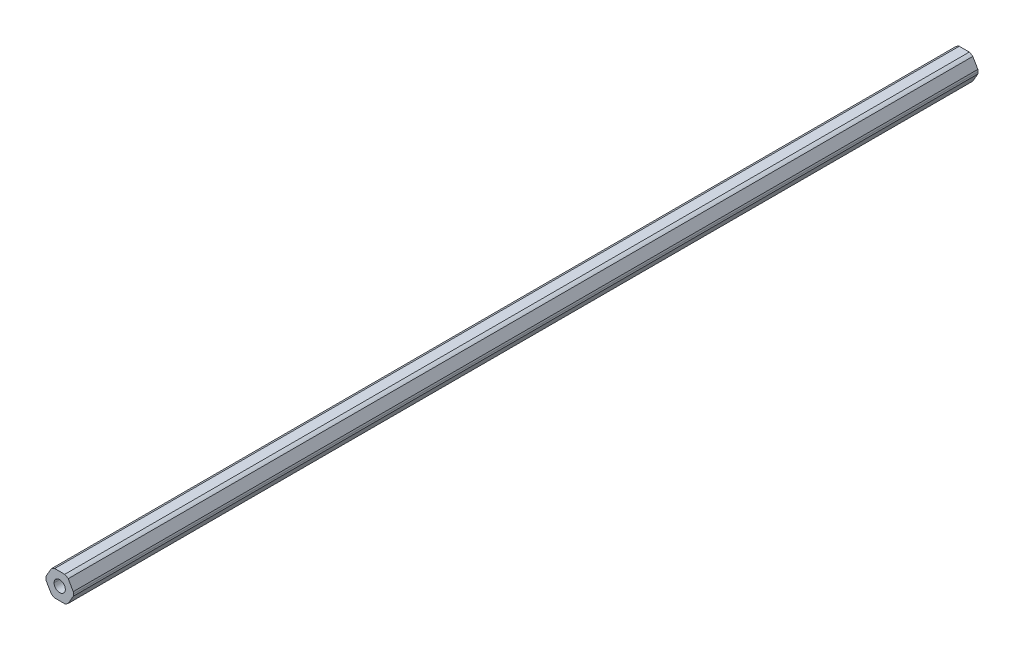
ISO-10303-21;
HEADER;
FILE_DESCRIPTION(('STEP AP214'),'2;1');
FILE_NAME('part.step','',(''),(''),'','','');
FILE_SCHEMA(('AUTOMOTIVE_DESIGN { 1 0 10303 214 1 1 1 1 }'));
ENDSEC;
DATA;
#1=APPLICATION_CONTEXT('core data for automotive mechanical design processes');
#2=APPLICATION_PROTOCOL_DEFINITION('international standard','automotive_design',2000,#1);
#3=PRODUCT_CONTEXT('',#1,'mechanical');
#4=PRODUCT('Part','Part','',(#3));
#5=PRODUCT_RELATED_PRODUCT_CATEGORY('part','',(#4));
#6=PRODUCT_DEFINITION_FORMATION('','',#4);
#7=PRODUCT_DEFINITION_CONTEXT('part definition',#1,'design');
#8=PRODUCT_DEFINITION('design','',#6,#7);
#9=PRODUCT_DEFINITION_SHAPE('','',#8);
#10=(LENGTH_UNIT() NAMED_UNIT(*) SI_UNIT(.MILLI.,.METRE.));
#11=(NAMED_UNIT(*) PLANE_ANGLE_UNIT() SI_UNIT($,.RADIAN.));
#12=(NAMED_UNIT(*) SI_UNIT($,.STERADIAN.) SOLID_ANGLE_UNIT());
#13=UNCERTAINTY_MEASURE_WITH_UNIT(LENGTH_MEASURE(1.E-05),#10,'distance_accuracy_value','');
#14=(GEOMETRIC_REPRESENTATION_CONTEXT(3) GLOBAL_UNCERTAINTY_ASSIGNED_CONTEXT((#13)) GLOBAL_UNIT_ASSIGNED_CONTEXT((#10,
#11,#12)) REPRESENTATION_CONTEXT('',''));
#15=CARTESIAN_POINT('',(0.,0.,0.));
#16=DIRECTION('',(0.,0.,1.));
#17=DIRECTION('',(1.,0.,0.));
#18=AXIS2_PLACEMENT_3D('',#15,#16,#17);
#19=CARTESIAN_POINT('',(0.,0.,-457.2));
#20=DIRECTION('',(0.,0.,1.));
#21=DIRECTION('',(1.,0.,0.));
#22=AXIS2_PLACEMENT_3D('',#19,#20,#21);
#23=CYLINDRICAL_SURFACE('',#22,2.1);
#24=CARTESIAN_POINT('',(0.,0.,-119.38));
#25=DIRECTION('',(0.,0.,1.));
#26=DIRECTION('',(1.,0.,0.));
#27=AXIS2_PLACEMENT_3D('',#24,#25,#26);
#28=CIRCLE('',#27,2.1);
#29=CARTESIAN_POINT('',(2.1,0.,-119.38));
#30=VERTEX_POINT('',#29);
#31=CARTESIAN_POINT('',(-2.1,0.,-119.38));
#32=VERTEX_POINT('',#31);
#33=EDGE_CURVE('E67',#30,#32,#28,.F.);
#34=ORIENTED_EDGE('',*,*,#33,.F.);
#35=DIRECTION('',(0.,0.,1.));
#36=VECTOR('',#35,1.);
#37=CARTESIAN_POINT('',(2.1,0.,-457.2));
#38=LINE('',#37,#36);
#39=CARTESIAN_POINT('',(2.1,0.,-457.2));
#40=VERTEX_POINT('',#39);
#41=EDGE_CURVE('E213',#40,#30,#38,.T.);
#42=ORIENTED_EDGE('',*,*,#41,.F.);
#43=CARTESIAN_POINT('',(0.,0.,-457.2));
#44=DIRECTION('',(0.,0.,1.));
#45=DIRECTION('',(1.,0.,0.));
#46=AXIS2_PLACEMENT_3D('',#43,#44,#45);
#47=CIRCLE('',#46,2.1);
#48=CARTESIAN_POINT('',(-2.1,0.,-457.2));
#49=VERTEX_POINT('',#48);
#50=EDGE_CURVE('E193',#49,#40,#47,.T.);
#51=ORIENTED_EDGE('',*,*,#50,.F.);
#52=DIRECTION('',(0.,0.,1.));
#53=VECTOR('',#52,1.);
#54=CARTESIAN_POINT('',(-2.1,0.,-457.2));
#55=LINE('',#54,#53);
#56=EDGE_CURVE('E54',#49,#32,#55,.T.);
#57=ORIENTED_EDGE('',*,*,#56,.T.);
#58=EDGE_LOOP('',(#34,#42,#51,#57));
#59=FACE_BOUND('',#58,.T.);
#60=ADVANCED_FACE('F46',(#59),#23,.F.);
#61=CARTESIAN_POINT('',(0.,0.,-457.2));
#62=DIRECTION('',(0.,0.,1.));
#63=DIRECTION('',(1.,0.,0.));
#64=AXIS2_PLACEMENT_3D('',#61,#62,#63);
#65=CYLINDRICAL_SURFACE('',#64,5.12);
#66=DIRECTION('',(0.,0.,1.));
#67=VECTOR('',#66,1.);
#68=CARTESIAN_POINT('',(5.12,0.,-457.2));
#69=LINE('',#68,#67);
#70=CARTESIAN_POINT('',(5.12,0.,-457.2));
#71=VERTEX_POINT('',#70);
#72=CARTESIAN_POINT('',(5.12,0.,-119.38));
#73=VERTEX_POINT('',#72);
#74=EDGE_CURVE('E229',#71,#73,#69,.T.);
#75=ORIENTED_EDGE('',*,*,#74,.T.);
#76=CARTESIAN_POINT('',(0.,0.,-119.38));
#77=DIRECTION('',(0.,0.,1.));
#78=DIRECTION('',(1.,0.,0.));
#79=AXIS2_PLACEMENT_3D('',#76,#77,#78);
#80=CIRCLE('',#79,5.12);
#81=CARTESIAN_POINT('',(5.06425896558911,-0.753446168913433,-119.38));
#82=VERTEX_POINT('',#81);
#83=EDGE_CURVE('E168',#82,#73,#80,.T.);
#84=ORIENTED_EDGE('',*,*,#83,.F.);
#85=DIRECTION('',(0.,0.,-1.));
#86=VECTOR('',#85,1.);
#87=CARTESIAN_POINT('',(5.06425896558911,-0.753446168913433,-457.2));
#88=LINE('',#87,#86);
#89=CARTESIAN_POINT('',(5.06425896558911,-0.753446168913433,-457.2));
#90=VERTEX_POINT('',#89);
#91=EDGE_CURVE('E232',#82,#90,#88,.T.);
#92=ORIENTED_EDGE('',*,*,#91,.T.);
#93=CARTESIAN_POINT('',(0.,0.,-457.2));
#94=DIRECTION('',(0.,0.,1.));
#95=DIRECTION('',(1.,0.,0.));
#96=AXIS2_PLACEMENT_3D('',#93,#94,#95);
#97=CIRCLE('',#96,5.12);
#98=EDGE_CURVE('E231',#90,#71,#97,.T.);
#99=ORIENTED_EDGE('',*,*,#98,.T.);
#100=EDGE_LOOP('',(#75,#84,#92,#99));
#101=FACE_BOUND('',#100,.T.);
#102=ADVANCED_FACE('F356',(#101),#65,.T.);
#103=CARTESIAN_POINT('',(2.74963065701564,-4.7625,457.2));
#104=DIRECTION('',(-0.866025403784442,0.5,0.));
#105=DIRECTION('',(0.,0.,1.));
#106=AXIS2_PLACEMENT_3D('',#103,#104,#105);
#107=PLANE('',#106);
#108=DIRECTION('',(0.499999999999991,0.866025403784444,0.));
#109=VECTOR('',#108,1.);
#110=CARTESIAN_POINT('',(3.18463300545771,-4.00905383108654,-119.38));
#111=LINE('',#110,#109);
#112=CARTESIAN_POINT('',(3.18463300545771,-4.00905383108654,-119.38));
#113=VERTEX_POINT('',#112);
#114=EDGE_CURVE('E315',#113,#82,#111,.T.);
#115=ORIENTED_EDGE('',*,*,#114,.F.);
#116=DIRECTION('',(0.,0.,1.));
#117=VECTOR('',#116,1.);
#118=CARTESIAN_POINT('',(3.1846330054577,-4.00905383108652,-457.2));
#119=LINE('',#118,#117);
#120=CARTESIAN_POINT('',(3.1846330054577,-4.00905383108652,-457.2));
#121=VERTEX_POINT('',#120);
#122=EDGE_CURVE('E187',#121,#113,#119,.T.);
#123=ORIENTED_EDGE('',*,*,#122,.F.);
#124=DIRECTION('',(0.5,0.866025403784442,0.));
#125=VECTOR('',#124,1.);
#126=CARTESIAN_POINT('',(2.74963065701564,-4.7625,-457.2));
#127=LINE('',#126,#125);
#128=EDGE_CURVE('E242',#121,#90,#127,.T.);
#129=ORIENTED_EDGE('',*,*,#128,.T.);
#130=ORIENTED_EDGE('',*,*,#91,.F.);
#131=EDGE_LOOP('',(#115,#123,#129,#130));
#132=FACE_BOUND('',#131,.T.);
#133=ADVANCED_FACE('F353',(#132),#107,.F.);
#134=CARTESIAN_POINT('',(5.49926131403117,0.,457.2));
#135=DIRECTION('',(-0.866025403784438,-0.5,0.));
#136=DIRECTION('',(-0.5,0.866025403784438,0.));
#137=AXIS2_PLACEMENT_3D('',#134,#135,#136);
#138=PLANE('',#137);
#139=DIRECTION('',(-0.500000000000001,0.866025403784438,0.));
#140=VECTOR('',#139,1.);
#141=CARTESIAN_POINT('',(5.06425896558911,0.753446168913416,-119.38));
#142=LINE('',#141,#140);
#143=CARTESIAN_POINT('',(5.06425896558911,0.753446168913416,-119.38));
#144=VERTEX_POINT('',#143);
#145=CARTESIAN_POINT('',(3.18463300545762,4.00905383108658,-119.38));
#146=VERTEX_POINT('',#145);
#147=EDGE_CURVE('E61',#144,#146,#142,.T.);
#148=ORIENTED_EDGE('',*,*,#147,.F.);
#149=DIRECTION('',(0.,0.,1.));
#150=VECTOR('',#149,1.);
#151=CARTESIAN_POINT('',(5.06425896558911,0.753446168913412,-457.2));
#152=LINE('',#151,#150);
#153=CARTESIAN_POINT('',(5.06425896558911,0.753446168913416,-457.2));
#154=VERTEX_POINT('',#153);
#155=EDGE_CURVE('E177',#154,#144,#152,.T.);
#156=ORIENTED_EDGE('',*,*,#155,.F.);
#157=DIRECTION('',(-0.5,0.866025403784438,0.));
#158=VECTOR('',#157,1.);
#159=CARTESIAN_POINT('',(5.49926131403117,0.,-457.2));
#160=LINE('',#159,#158);
#161=CARTESIAN_POINT('',(3.18463300545762,4.00905383108658,-457.2));
#162=VERTEX_POINT('',#161);
#163=EDGE_CURVE('E223',#154,#162,#160,.T.);
#164=ORIENTED_EDGE('',*,*,#163,.T.);
#165=DIRECTION('',(0.,0.,-1.));
#166=VECTOR('',#165,1.);
#167=CARTESIAN_POINT('',(3.18463300545762,4.00905383108658,-457.2));
#168=LINE('',#167,#166);
#169=EDGE_CURVE('E179',#146,#162,#168,.T.);
#170=ORIENTED_EDGE('',*,*,#169,.F.);
#171=EDGE_LOOP('',(#148,#156,#164,#170));
#172=FACE_BOUND('',#171,.T.);
#173=ADVANCED_FACE('F175',(#172),#138,.F.);
#174=CARTESIAN_POINT('',(2.74963065701557,4.7625,457.2));
#175=DIRECTION('',(0.,-1.,0.));
#176=DIRECTION('',(0.,0.,-1.));
#177=AXIS2_PLACEMENT_3D('',#174,#175,#176);
#178=PLANE('',#177);
#179=DIRECTION('',(-1.,0.,0.));
#180=VECTOR('',#179,1.);
#181=CARTESIAN_POINT('',(1.87962596013146,4.76249999999999,-119.38));
#182=LINE('',#181,#180);
#183=CARTESIAN_POINT('',(1.87962596013146,4.76249999999999,-119.38));
#184=VERTEX_POINT('',#183);
#185=CARTESIAN_POINT('',(-1.8796259601315,4.7625,-119.38));
#186=VERTEX_POINT('',#185);
#187=EDGE_CURVE('E330',#184,#186,#182,.T.);
#188=ORIENTED_EDGE('',*,*,#187,.F.);
#189=DIRECTION('',(0.,0.,1.));
#190=VECTOR('',#189,1.);
#191=CARTESIAN_POINT('',(1.87962596013147,4.7625,-457.2));
#192=LINE('',#191,#190);
#193=CARTESIAN_POINT('',(1.87962596013147,4.7625,-457.2));
#194=VERTEX_POINT('',#193);
#195=EDGE_CURVE('E204',#194,#184,#192,.T.);
#196=ORIENTED_EDGE('',*,*,#195,.F.);
#197=DIRECTION('',(-1.,0.,0.));
#198=VECTOR('',#197,1.);
#199=CARTESIAN_POINT('',(2.74963065701557,4.7625,-457.2));
#200=LINE('',#199,#198);
#201=CARTESIAN_POINT('',(-1.8796259601315,4.7625,-457.2));
#202=VERTEX_POINT('',#201);
#203=EDGE_CURVE('E257',#194,#202,#200,.T.);
#204=ORIENTED_EDGE('',*,*,#203,.T.);
#205=DIRECTION('',(0.,0.,-1.));
#206=VECTOR('',#205,1.);
#207=CARTESIAN_POINT('',(-1.8796259601315,4.7625,-457.2));
#208=LINE('',#207,#206);
#209=EDGE_CURVE('E251',#186,#202,#208,.T.);
#210=ORIENTED_EDGE('',*,*,#209,.F.);
#211=EDGE_LOOP('',(#188,#196,#204,#210));
#212=FACE_BOUND('',#211,.T.);
#213=ADVANCED_FACE('F336',(#212),#178,.F.);
#214=CARTESIAN_POINT('',(-2.7496306570156,4.7625,457.2));
#215=DIRECTION('',(0.866025403784442,-0.5,0.));
#216=DIRECTION('',(0.,0.,-1.));
#217=AXIS2_PLACEMENT_3D('',#214,#215,#216);
#218=PLANE('',#217);
#219=DIRECTION('',(-0.499999999999993,-0.866025403784443,0.));
#220=VECTOR('',#219,1.);
#221=CARTESIAN_POINT('',(-3.18463300545766,4.00905383108656,-119.38));
#222=LINE('',#221,#220);
#223=CARTESIAN_POINT('',(-3.18463300545767,4.00905383108657,-119.38));
#224=VERTEX_POINT('',#223);
#225=CARTESIAN_POINT('',(-5.06425896558912,0.753446168913382,-119.38));
#226=VERTEX_POINT('',#225);
#227=EDGE_CURVE('E326',#224,#226,#222,.T.);
#228=ORIENTED_EDGE('',*,*,#227,.F.);
#229=DIRECTION('',(0.,0.,1.));
#230=VECTOR('',#229,1.);
#231=CARTESIAN_POINT('',(-3.18463300545766,4.00905383108655,-457.2));
#232=LINE('',#231,#230);
#233=CARTESIAN_POINT('',(-3.18463300545766,4.00905383108655,-457.2));
#234=VERTEX_POINT('',#233);
#235=EDGE_CURVE('E210',#234,#224,#232,.T.);
#236=ORIENTED_EDGE('',*,*,#235,.F.);
#237=DIRECTION('',(-0.5,-0.866025403784442,0.));
#238=VECTOR('',#237,1.);
#239=CARTESIAN_POINT('',(-2.7496306570156,4.7625,-457.2));
#240=LINE('',#239,#238);
#241=CARTESIAN_POINT('',(-5.06425896558912,0.753446168913382,-457.2));
#242=VERTEX_POINT('',#241);
#243=EDGE_CURVE('E254',#234,#242,#240,.T.);
#244=ORIENTED_EDGE('',*,*,#243,.T.);
#245=DIRECTION('',(0.,0.,-1.));
#246=VECTOR('',#245,1.);
#247=CARTESIAN_POINT('',(-5.06425896558912,0.753446168913382,-457.2));
#248=LINE('',#247,#246);
#249=EDGE_CURVE('E241',#226,#242,#248,.T.);
#250=ORIENTED_EDGE('',*,*,#249,.F.);
#251=EDGE_LOOP('',(#228,#236,#244,#250));
#252=FACE_BOUND('',#251,.T.);
#253=ADVANCED_FACE('F269',(#252),#218,.F.);
#254=CARTESIAN_POINT('',(-5.49926131403117,0.,457.2));
#255=DIRECTION('',(0.866025403784435,0.500000000000007,0.));
#256=DIRECTION('',(0.,0.,-1.));
#257=AXIS2_PLACEMENT_3D('',#254,#255,#256);
#258=PLANE('',#257);
#259=DIRECTION('',(0.500000000000007,-0.866025403784435,0.));
#260=VECTOR('',#259,1.);
#261=CARTESIAN_POINT('',(-5.06425896558911,-0.753446168913448,-119.38));
#262=LINE('',#261,#260);
#263=CARTESIAN_POINT('',(-5.06425896558911,-0.753446168913446,-119.38));
#264=VERTEX_POINT('',#263);
#265=CARTESIAN_POINT('',(-3.1846330054576,-4.0090538310866,-119.38));
#266=VERTEX_POINT('',#265);
#267=EDGE_CURVE('E323',#264,#266,#262,.T.);
#268=ORIENTED_EDGE('',*,*,#267,.F.);
#269=DIRECTION('',(0.,0.,1.));
#270=VECTOR('',#269,1.);
#271=CARTESIAN_POINT('',(-5.06425896558911,-0.75344616891345,-457.2));
#272=LINE('',#271,#270);
#273=CARTESIAN_POINT('',(-5.06425896558911,-0.75344616891345,-457.2));
#274=VERTEX_POINT('',#273);
#275=EDGE_CURVE('E249',#274,#264,#272,.T.);
#276=ORIENTED_EDGE('',*,*,#275,.F.);
#277=DIRECTION('',(0.500000000000007,-0.866025403784435,0.));
#278=VECTOR('',#277,1.);
#279=CARTESIAN_POINT('',(-5.49926131403117,0.,-457.2));
#280=LINE('',#279,#278);
#281=CARTESIAN_POINT('',(-3.1846330054576,-4.0090538310866,-457.2));
#282=VERTEX_POINT('',#281);
#283=EDGE_CURVE('E258',#274,#282,#280,.T.);
#284=ORIENTED_EDGE('',*,*,#283,.T.);
#285=DIRECTION('',(0.,0.,-1.));
#286=VECTOR('',#285,1.);
#287=CARTESIAN_POINT('',(-3.1846330054576,-4.0090538310866,-457.2));
#288=LINE('',#287,#286);
#289=EDGE_CURVE('E225',#266,#282,#288,.T.);
#290=ORIENTED_EDGE('',*,*,#289,.F.);
#291=EDGE_LOOP('',(#268,#276,#284,#290));
#292=FACE_BOUND('',#291,.T.);
#293=ADVANCED_FACE('F342',(#292),#258,.F.);
#294=CARTESIAN_POINT('',(-2.74963065701554,-4.7625,457.2));
#295=DIRECTION('',(0.,1.,0.));
#296=DIRECTION('',(1.,0.,0.));
#297=AXIS2_PLACEMENT_3D('',#294,#295,#296);
#298=PLANE('',#297);
#299=DIRECTION('',(1.,0.,0.));
#300=VECTOR('',#299,1.);
#301=CARTESIAN_POINT('',(-1.87962596013144,-4.7625,-119.38));
#302=LINE('',#301,#300);
#303=CARTESIAN_POINT('',(-1.87962596013144,-4.7625,-119.38));
#304=VERTEX_POINT('',#303);
#305=CARTESIAN_POINT('',(1.87962596013154,-4.7625,-119.38));
#306=VERTEX_POINT('',#305);
#307=EDGE_CURVE('E319',#304,#306,#302,.T.);
#308=ORIENTED_EDGE('',*,*,#307,.F.);
#309=DIRECTION('',(0.,0.,1.));
#310=VECTOR('',#309,1.);
#311=CARTESIAN_POINT('',(-1.87962596013144,-4.7625,-457.2));
#312=LINE('',#311,#310);
#313=CARTESIAN_POINT('',(-1.87962596013144,-4.7625,-457.2));
#314=VERTEX_POINT('',#313);
#315=EDGE_CURVE('E237',#314,#304,#312,.T.);
#316=ORIENTED_EDGE('',*,*,#315,.F.);
#317=DIRECTION('',(1.,0.,0.));
#318=VECTOR('',#317,1.);
#319=CARTESIAN_POINT('',(-2.74963065701554,-4.7625,-457.2));
#320=LINE('',#319,#318);
#321=CARTESIAN_POINT('',(1.87962596013154,-4.7625,-457.2));
#322=VERTEX_POINT('',#321);
#323=EDGE_CURVE('E282',#314,#322,#320,.T.);
#324=ORIENTED_EDGE('',*,*,#323,.T.);
#325=DIRECTION('',(0.,0.,-1.));
#326=VECTOR('',#325,1.);
#327=CARTESIAN_POINT('',(1.87962596013154,-4.7625,-457.2));
#328=LINE('',#327,#326);
#329=EDGE_CURVE('E197',#306,#322,#328,.T.);
#330=ORIENTED_EDGE('',*,*,#329,.F.);
#331=EDGE_LOOP('',(#308,#316,#324,#330));
#332=FACE_BOUND('',#331,.T.);
#333=ADVANCED_FACE('F347',(#332),#298,.F.);
#334=CARTESIAN_POINT('',(0.,0.,-457.2));
#335=DIRECTION('',(0.,0.,1.));
#336=DIRECTION('',(1.,0.,0.));
#337=AXIS2_PLACEMENT_3D('',#334,#335,#336);
#338=CYLINDRICAL_SURFACE('',#337,5.12);
#339=ORIENTED_EDGE('',*,*,#155,.T.);
#340=EDGE_CURVE('E165',#73,#144,#80,.T.);
#341=ORIENTED_EDGE('',*,*,#340,.F.);
#342=ORIENTED_EDGE('',*,*,#74,.F.);
#343=CARTESIAN_POINT('',(0.,0.,-457.2));
#344=DIRECTION('',(0.,0.,1.));
#345=DIRECTION('',(1.,0.,0.));
#346=AXIS2_PLACEMENT_3D('',#343,#344,#345);
#347=CIRCLE('',#346,5.12);
#348=EDGE_CURVE('E185',#71,#154,#347,.T.);
#349=ORIENTED_EDGE('',*,*,#348,.T.);
#350=EDGE_LOOP('',(#339,#341,#342,#349));
#351=FACE_BOUND('',#350,.T.);
#352=ADVANCED_FACE('F183',(#351),#338,.T.);
#353=CARTESIAN_POINT('',(0.,0.,-457.2));
#354=DIRECTION('',(0.,0.,1.));
#355=DIRECTION('',(1.,0.,0.));
#356=AXIS2_PLACEMENT_3D('',#353,#354,#355);
#357=CYLINDRICAL_SURFACE('',#356,5.12);
#358=ORIENTED_EDGE('',*,*,#122,.T.);
#359=CARTESIAN_POINT('',(0.,0.,-119.38));
#360=DIRECTION('',(0.,0.,1.));
#361=DIRECTION('',(1.,0.,0.));
#362=AXIS2_PLACEMENT_3D('',#359,#360,#361);
#363=CIRCLE('',#362,5.12000000000003);
#364=EDGE_CURVE('E317',#306,#113,#363,.T.);
#365=ORIENTED_EDGE('',*,*,#364,.F.);
#366=ORIENTED_EDGE('',*,*,#329,.T.);
#367=CARTESIAN_POINT('',(0.,0.,-457.2));
#368=DIRECTION('',(0.,0.,1.));
#369=DIRECTION('',(1.,0.,0.));
#370=AXIS2_PLACEMENT_3D('',#367,#368,#369);
#371=CIRCLE('',#370,5.12);
#372=EDGE_CURVE('E227',#322,#121,#371,.T.);
#373=ORIENTED_EDGE('',*,*,#372,.T.);
#374=EDGE_LOOP('',(#358,#365,#366,#373));
#375=FACE_BOUND('',#374,.T.);
#376=ADVANCED_FACE('F354',(#375),#357,.T.);
#377=CARTESIAN_POINT('',(0.,0.,-457.2));
#378=DIRECTION('',(0.,0.,1.));
#379=DIRECTION('',(1.,0.,0.));
#380=AXIS2_PLACEMENT_3D('',#377,#378,#379);
#381=CYLINDRICAL_SURFACE('',#380,5.12);
#382=ORIENTED_EDGE('',*,*,#315,.T.);
#383=CARTESIAN_POINT('',(0.,0.,-119.38));
#384=DIRECTION('',(0.,0.,1.));
#385=DIRECTION('',(1.,0.,0.));
#386=AXIS2_PLACEMENT_3D('',#383,#384,#385);
#387=CIRCLE('',#386,5.12);
#388=EDGE_CURVE('E321',#266,#304,#387,.T.);
#389=ORIENTED_EDGE('',*,*,#388,.F.);
#390=ORIENTED_EDGE('',*,*,#289,.T.);
#391=CARTESIAN_POINT('',(0.,0.,-457.2));
#392=DIRECTION('',(0.,0.,1.));
#393=DIRECTION('',(1.,0.,0.));
#394=AXIS2_PLACEMENT_3D('',#391,#392,#393);
#395=CIRCLE('',#394,5.12);
#396=EDGE_CURVE('E228',#282,#314,#395,.T.);
#397=ORIENTED_EDGE('',*,*,#396,.T.);
#398=EDGE_LOOP('',(#382,#389,#390,#397));
#399=FACE_BOUND('',#398,.T.);
#400=ADVANCED_FACE('F344',(#399),#381,.T.);
#401=CARTESIAN_POINT('',(0.,0.,-457.2));
#402=DIRECTION('',(0.,0.,1.));
#403=DIRECTION('',(1.,0.,0.));
#404=AXIS2_PLACEMENT_3D('',#401,#402,#403);
#405=CYLINDRICAL_SURFACE('',#404,5.12);
#406=ORIENTED_EDGE('',*,*,#275,.T.);
#407=CARTESIAN_POINT('',(0.,0.,-119.38));
#408=DIRECTION('',(0.,0.,1.));
#409=DIRECTION('',(1.,0.,0.));
#410=AXIS2_PLACEMENT_3D('',#407,#408,#409);
#411=CIRCLE('',#410,5.12);
#412=EDGE_CURVE('E265',#226,#264,#411,.T.);
#413=ORIENTED_EDGE('',*,*,#412,.F.);
#414=ORIENTED_EDGE('',*,*,#249,.T.);
#415=CARTESIAN_POINT('',(0.,0.,-457.2));
#416=DIRECTION('',(0.,0.,1.));
#417=DIRECTION('',(1.,0.,0.));
#418=AXIS2_PLACEMENT_3D('',#415,#416,#417);
#419=CIRCLE('',#418,5.12);
#420=EDGE_CURVE('E246',#242,#274,#419,.T.);
#421=ORIENTED_EDGE('',*,*,#420,.T.);
#422=EDGE_LOOP('',(#406,#413,#414,#421));
#423=FACE_BOUND('',#422,.T.);
#424=ADVANCED_FACE('F263',(#423),#405,.T.);
#425=CARTESIAN_POINT('',(0.,0.,-457.2));
#426=DIRECTION('',(0.,0.,1.));
#427=DIRECTION('',(1.,0.,0.));
#428=AXIS2_PLACEMENT_3D('',#425,#426,#427);
#429=CYLINDRICAL_SURFACE('',#428,5.12);
#430=ORIENTED_EDGE('',*,*,#235,.T.);
#431=CARTESIAN_POINT('',(0.,0.,-119.38));
#432=DIRECTION('',(0.,0.,1.));
#433=DIRECTION('',(1.,0.,0.));
#434=AXIS2_PLACEMENT_3D('',#431,#432,#433);
#435=CIRCLE('',#434,5.12000000000002);
#436=EDGE_CURVE('E328',#186,#224,#435,.T.);
#437=ORIENTED_EDGE('',*,*,#436,.F.);
#438=ORIENTED_EDGE('',*,*,#209,.T.);
#439=CARTESIAN_POINT('',(0.,0.,-457.2));
#440=DIRECTION('',(0.,0.,1.));
#441=DIRECTION('',(1.,0.,0.));
#442=AXIS2_PLACEMENT_3D('',#439,#440,#441);
#443=CIRCLE('',#442,5.12);
#444=EDGE_CURVE('E236',#202,#234,#443,.T.);
#445=ORIENTED_EDGE('',*,*,#444,.T.);
#446=EDGE_LOOP('',(#430,#437,#438,#445));
#447=FACE_BOUND('',#446,.T.);
#448=ADVANCED_FACE('F339',(#447),#429,.T.);
#449=CARTESIAN_POINT('',(0.,0.,-457.2));
#450=DIRECTION('',(0.,0.,1.));
#451=DIRECTION('',(1.,0.,0.));
#452=AXIS2_PLACEMENT_3D('',#449,#450,#451);
#453=CYLINDRICAL_SURFACE('',#452,5.12);
#454=ORIENTED_EDGE('',*,*,#195,.T.);
#455=CARTESIAN_POINT('',(0.,0.,-119.38));
#456=DIRECTION('',(0.,0.,1.));
#457=DIRECTION('',(1.,0.,0.));
#458=AXIS2_PLACEMENT_3D('',#455,#456,#457);
#459=CIRCLE('',#458,5.12);
#460=EDGE_CURVE('E180',#146,#184,#459,.T.);
#461=ORIENTED_EDGE('',*,*,#460,.F.);
#462=ORIENTED_EDGE('',*,*,#169,.T.);
#463=CARTESIAN_POINT('',(0.,0.,-457.2));
#464=DIRECTION('',(0.,0.,1.));
#465=DIRECTION('',(1.,0.,0.));
#466=AXIS2_PLACEMENT_3D('',#463,#464,#465);
#467=CIRCLE('',#466,5.12);
#468=EDGE_CURVE('E202',#162,#194,#467,.T.);
#469=ORIENTED_EDGE('',*,*,#468,.T.);
#470=EDGE_LOOP('',(#454,#461,#462,#469));
#471=FACE_BOUND('',#470,.T.);
#472=ADVANCED_FACE('F371',(#471),#453,.T.);
#473=CARTESIAN_POINT('',(0.,0.,-457.2));
#474=DIRECTION('',(0.,0.,1.));
#475=DIRECTION('',(1.,0.,0.));
#476=AXIS2_PLACEMENT_3D('',#473,#474,#475);
#477=CYLINDRICAL_SURFACE('',#476,2.1);
#478=CARTESIAN_POINT('',(0.,0.,-119.38));
#479=DIRECTION('',(0.,0.,1.));
#480=DIRECTION('',(1.,0.,0.));
#481=AXIS2_PLACEMENT_3D('',#478,#479,#480);
#482=CIRCLE('',#481,2.1);
#483=EDGE_CURVE('E11',#32,#30,#482,.F.);
#484=ORIENTED_EDGE('',*,*,#483,.F.);
#485=ORIENTED_EDGE('',*,*,#56,.F.);
#486=CARTESIAN_POINT('',(0.,0.,-457.2));
#487=DIRECTION('',(0.,0.,1.));
#488=DIRECTION('',(1.,0.,0.));
#489=AXIS2_PLACEMENT_3D('',#486,#487,#488);
#490=CIRCLE('',#489,2.1);
#491=EDGE_CURVE('E200',#40,#49,#490,.T.);
#492=ORIENTED_EDGE('',*,*,#491,.F.);
#493=ORIENTED_EDGE('',*,*,#41,.T.);
#494=EDGE_LOOP('',(#484,#485,#492,#493));
#495=FACE_BOUND('',#494,.T.);
#496=ADVANCED_FACE('F387',(#495),#477,.F.);
#497=CARTESIAN_POINT('',(0.,0.,-457.2));
#498=DIRECTION('',(0.,0.,1.));
#499=DIRECTION('',(1.,0.,0.));
#500=AXIS2_PLACEMENT_3D('',#497,#498,#499);
#501=PLANE('',#500);
#502=ORIENTED_EDGE('',*,*,#468,.F.);
#503=ORIENTED_EDGE('',*,*,#163,.F.);
#504=ORIENTED_EDGE('',*,*,#348,.F.);
#505=ORIENTED_EDGE('',*,*,#98,.F.);
#506=ORIENTED_EDGE('',*,*,#128,.F.);
#507=ORIENTED_EDGE('',*,*,#372,.F.);
#508=ORIENTED_EDGE('',*,*,#323,.F.);
#509=ORIENTED_EDGE('',*,*,#396,.F.);
#510=ORIENTED_EDGE('',*,*,#283,.F.);
#511=ORIENTED_EDGE('',*,*,#420,.F.);
#512=ORIENTED_EDGE('',*,*,#243,.F.);
#513=ORIENTED_EDGE('',*,*,#444,.F.);
#514=ORIENTED_EDGE('',*,*,#203,.F.);
#515=EDGE_LOOP('',(#502,#503,#504,#505,#506,#507,#508,#509,#510,#511,#512,#513,#514));
#516=FACE_BOUND('',#515,.T.);
#517=ORIENTED_EDGE('',*,*,#491,.T.);
#518=ORIENTED_EDGE('',*,*,#50,.T.);
#519=EDGE_LOOP('',(#517,#518));
#520=FACE_BOUND('',#519,.T.);
#521=ADVANCED_FACE('F48',(#516,#520),#501,.F.);
#522=CARTESIAN_POINT('',(0.,0.,-119.38));
#523=DIRECTION('',(0.,0.,1.));
#524=DIRECTION('',(1.,0.,0.));
#525=AXIS2_PLACEMENT_3D('',#522,#523,#524);
#526=PLANE('',#525);
#527=ORIENTED_EDGE('',*,*,#83,.T.);
#528=ORIENTED_EDGE('',*,*,#340,.T.);
#529=ORIENTED_EDGE('',*,*,#147,.T.);
#530=ORIENTED_EDGE('',*,*,#460,.T.);
#531=ORIENTED_EDGE('',*,*,#187,.T.);
#532=ORIENTED_EDGE('',*,*,#436,.T.);
#533=ORIENTED_EDGE('',*,*,#227,.T.);
#534=ORIENTED_EDGE('',*,*,#412,.T.);
#535=ORIENTED_EDGE('',*,*,#267,.T.);
#536=ORIENTED_EDGE('',*,*,#388,.T.);
#537=ORIENTED_EDGE('',*,*,#307,.T.);
#538=ORIENTED_EDGE('',*,*,#364,.T.);
#539=ORIENTED_EDGE('',*,*,#114,.T.);
#540=EDGE_LOOP('',(#527,#528,#529,#530,#531,#532,#533,#534,#535,#536,#537,#538,#539));
#541=FACE_BOUND('',#540,.T.);
#542=ORIENTED_EDGE('',*,*,#33,.T.);
#543=ORIENTED_EDGE('',*,*,#483,.T.);
#544=EDGE_LOOP('',(#542,#543));
#545=FACE_BOUND('',#544,.T.);
#546=ADVANCED_FACE('F166',(#541,#545),#526,.T.);
#547=CLOSED_SHELL('',(#60,#102,#133,#173,#213,#253,#293,#333,#352,#376,#400,#424,#448,#472,#496,
#521,#546));
#548=MANIFOLD_SOLID_BREP('B2',#547);
#549=ADVANCED_BREP_SHAPE_REPRESENTATION('',(#18,#548),#14);
#550=SHAPE_DEFINITION_REPRESENTATION(#9,#549);
ENDSEC;
END-ISO-10303-21;
